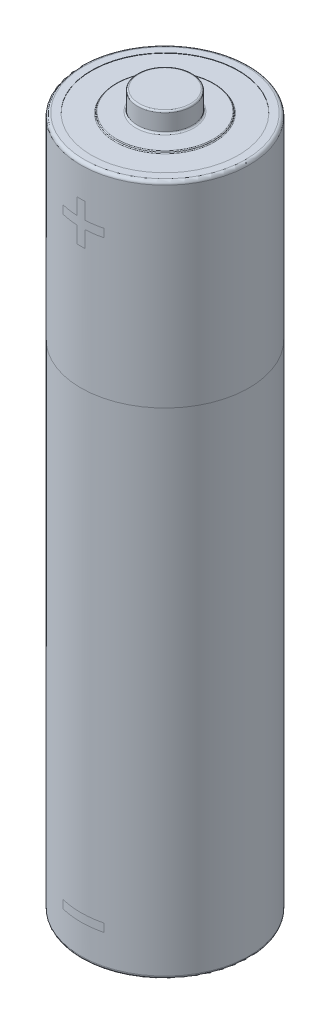
ISO-10303-21;
HEADER;
FILE_DESCRIPTION(('STEP AP214'),'2;1');
FILE_NAME('part.step','',(''),(''),'','','');
FILE_SCHEMA(('AUTOMOTIVE_DESIGN { 1 0 10303 214 1 1 1 1 }'));
ENDSEC;
DATA;
#1=APPLICATION_CONTEXT('core data for automotive mechanical design processes');
#2=APPLICATION_PROTOCOL_DEFINITION('international standard','automotive_design',2000,#1);
#3=PRODUCT_CONTEXT('',#1,'mechanical');
#4=PRODUCT('Part','Part','',(#3));
#5=PRODUCT_RELATED_PRODUCT_CATEGORY('part','',(#4));
#6=PRODUCT_DEFINITION_FORMATION('','',#4);
#7=PRODUCT_DEFINITION_CONTEXT('part definition',#1,'design');
#8=PRODUCT_DEFINITION('design','',#6,#7);
#9=PRODUCT_DEFINITION_SHAPE('','',#8);
#10=(LENGTH_UNIT() NAMED_UNIT(*) SI_UNIT(.MILLI.,.METRE.));
#11=(NAMED_UNIT(*) PLANE_ANGLE_UNIT() SI_UNIT($,.RADIAN.));
#12=(NAMED_UNIT(*) SI_UNIT($,.STERADIAN.) SOLID_ANGLE_UNIT());
#13=UNCERTAINTY_MEASURE_WITH_UNIT(LENGTH_MEASURE(1.E-05),#10,'distance_accuracy_value','');
#14=(GEOMETRIC_REPRESENTATION_CONTEXT(3) GLOBAL_UNCERTAINTY_ASSIGNED_CONTEXT((#13)) GLOBAL_UNIT_ASSIGNED_CONTEXT((#10,
#11,#12)) REPRESENTATION_CONTEXT('',''));
#15=CARTESIAN_POINT('',(0.,0.,0.));
#16=DIRECTION('',(0.,0.,1.));
#17=DIRECTION('',(1.,0.,0.));
#18=AXIS2_PLACEMENT_3D('',#15,#16,#17);
#19=CARTESIAN_POINT('',(0.,42.35,0.));
#20=DIRECTION('',(0.,-1.,0.));
#21=DIRECTION('',(0.,0.,-1.));
#22=AXIS2_PLACEMENT_3D('',#19,#20,#21);
#23=CYLINDRICAL_SURFACE('',#22,5.15);
#24=DIRECTION('',(0.,-1.,0.));
#25=VECTOR('',#24,1.);
#26=CARTESIAN_POINT('',(-1.25,42.35,4.99599839871872));
#27=LINE('',#26,#25);
#28=CARTESIAN_POINT('',(-1.25,2.5,4.99599839871872));
#29=VERTEX_POINT('',#28);
#30=CARTESIAN_POINT('',(-1.25,2.,4.99599839871872));
#31=VERTEX_POINT('',#30);
#32=EDGE_CURVE('E25',#29,#31,#27,.T.);
#33=ORIENTED_EDGE('',*,*,#32,.F.);
#34=CARTESIAN_POINT('',(0.,2.5,0.));
#35=DIRECTION('',(0.,-1.,0.));
#36=DIRECTION('',(0.,0.,-1.));
#37=AXIS2_PLACEMENT_3D('',#34,#35,#36);
#38=CIRCLE('',#37,5.15);
#39=CARTESIAN_POINT('',(1.25,2.5,4.99599839871872));
#40=VERTEX_POINT('',#39);
#41=EDGE_CURVE('E194',#40,#29,#38,.T.);
#42=ORIENTED_EDGE('',*,*,#41,.F.);
#43=DIRECTION('',(0.,-1.,0.));
#44=VECTOR('',#43,1.);
#45=CARTESIAN_POINT('',(1.25,42.35,4.99599839871872));
#46=LINE('',#45,#44);
#47=CARTESIAN_POINT('',(1.25,2.,4.99599839871872));
#48=VERTEX_POINT('',#47);
#49=EDGE_CURVE('E202',#48,#40,#46,.F.);
#50=ORIENTED_EDGE('',*,*,#49,.F.);
#51=CARTESIAN_POINT('',(0.,2.,0.));
#52=DIRECTION('',(0.,1.,0.));
#53=DIRECTION('',(0.,0.,1.));
#54=AXIS2_PLACEMENT_3D('',#51,#52,#53);
#55=CIRCLE('',#54,5.15);
#56=EDGE_CURVE('E35',#31,#48,#55,.T.);
#57=ORIENTED_EDGE('',*,*,#56,.F.);
#58=EDGE_LOOP('',(#33,#42,#50,#57));
#59=FACE_BOUND('',#58,.T.);
#60=CARTESIAN_POINT('',(0.,0.2,0.));
#61=DIRECTION('',(0.,1.,0.));
#62=DIRECTION('',(0.,0.,1.));
#63=AXIS2_PLACEMENT_3D('',#60,#61,#62);
#64=CIRCLE('',#63,5.15);
#65=CARTESIAN_POINT('',(0.,0.2,5.15));
#66=VERTEX_POINT('',#65);
#67=EDGE_CURVE('E212',#66,#66,#64,.T.);
#68=ORIENTED_EDGE('',*,*,#67,.T.);
#69=EDGE_LOOP('',(#68));
#70=FACE_BOUND('',#69,.T.);
#71=DIRECTION('',(0.,-1.,0.));
#72=VECTOR('',#71,1.);
#73=CARTESIAN_POINT('',(-1.25,42.35,-4.99599839871872));
#74=LINE('',#73,#72);
#75=CARTESIAN_POINT('',(-1.25,2.,-4.99599839871872));
#76=VERTEX_POINT('',#75);
#77=CARTESIAN_POINT('',(-1.25,2.5,-4.99599839871872));
#78=VERTEX_POINT('',#77);
#79=EDGE_CURVE('E200',#76,#78,#74,.F.);
#80=ORIENTED_EDGE('',*,*,#79,.F.);
#81=CARTESIAN_POINT('',(1.25,2.,-4.99599839871872));
#82=VERTEX_POINT('',#81);
#83=EDGE_CURVE('E197',#82,#76,#55,.T.);
#84=ORIENTED_EDGE('',*,*,#83,.F.);
#85=DIRECTION('',(0.,-1.,0.));
#86=VECTOR('',#85,1.);
#87=CARTESIAN_POINT('',(1.25,42.35,-4.99599839871872));
#88=LINE('',#87,#86);
#89=CARTESIAN_POINT('',(1.25,2.5,-4.99599839871872));
#90=VERTEX_POINT('',#89);
#91=EDGE_CURVE('E193',#90,#82,#88,.T.);
#92=ORIENTED_EDGE('',*,*,#91,.F.);
#93=EDGE_CURVE('E190',#78,#90,#38,.T.);
#94=ORIENTED_EDGE('',*,*,#93,.F.);
#95=EDGE_LOOP('',(#80,#84,#92,#94));
#96=FACE_BOUND('',#95,.T.);
#97=CARTESIAN_POINT('',(0.,30.33,0.));
#98=DIRECTION('',(0.,1.,0.));
#99=DIRECTION('',(0.,0.,1.));
#100=AXIS2_PLACEMENT_3D('',#97,#98,#99);
#101=CIRCLE('',#100,5.15);
#102=CARTESIAN_POINT('',(0.,30.33,5.15));
#103=VERTEX_POINT('',#102);
#104=EDGE_CURVE('E11',#103,#103,#101,.T.);
#105=ORIENTED_EDGE('',*,*,#104,.F.);
#106=EDGE_LOOP('',(#105));
#107=FACE_BOUND('',#106,.T.);
#108=ADVANCED_FACE('F17',(#59,#70,#96,#107),#23,.T.);
#109=ORIENTED_EDGE('',*,*,#104,.T.);
#110=EDGE_LOOP('',(#109));
#111=FACE_BOUND('',#110,.T.);
#112=CARTESIAN_POINT('',(0.,39.35,0.));
#113=DIRECTION('',(0.,-1.,0.));
#114=DIRECTION('',(0.,0.,-1.));
#115=AXIS2_PLACEMENT_3D('',#112,#113,#114);
#116=CIRCLE('',#115,5.15);
#117=CARTESIAN_POINT('',(-1.25,39.35,-4.99599839871872));
#118=VERTEX_POINT('',#117);
#119=CARTESIAN_POINT('',(-0.25,39.35,-5.14392845984467));
#120=VERTEX_POINT('',#119);
#121=EDGE_CURVE('E127',#118,#120,#116,.T.);
#122=ORIENTED_EDGE('',*,*,#121,.F.);
#123=DIRECTION('',(0.,-1.,0.));
#124=VECTOR('',#123,1.);
#125=CARTESIAN_POINT('',(-1.25,42.35,-4.99599839871872));
#126=LINE('',#125,#124);
#127=CARTESIAN_POINT('',(-1.25,38.85,-4.99599839871872));
#128=VERTEX_POINT('',#127);
#129=EDGE_CURVE('E133',#128,#118,#126,.F.);
#130=ORIENTED_EDGE('',*,*,#129,.F.);
#131=CARTESIAN_POINT('',(0.,38.85,0.));
#132=DIRECTION('',(0.,1.,0.));
#133=DIRECTION('',(0.,0.,1.));
#134=AXIS2_PLACEMENT_3D('',#131,#132,#133);
#135=CIRCLE('',#134,5.15);
#136=CARTESIAN_POINT('',(-0.25,38.85,-5.14392845984467));
#137=VERTEX_POINT('',#136);
#138=EDGE_CURVE('E174',#137,#128,#135,.T.);
#139=ORIENTED_EDGE('',*,*,#138,.F.);
#140=DIRECTION('',(0.,-1.,0.));
#141=VECTOR('',#140,1.);
#142=CARTESIAN_POINT('',(-0.25,42.35,-5.14392845984467));
#143=LINE('',#142,#141);
#144=CARTESIAN_POINT('',(-0.25,37.85,-5.14392845984467));
#145=VERTEX_POINT('',#144);
#146=EDGE_CURVE('E170',#145,#137,#143,.F.);
#147=ORIENTED_EDGE('',*,*,#146,.F.);
#148=CARTESIAN_POINT('',(0.,37.85,0.));
#149=DIRECTION('',(0.,1.,0.));
#150=DIRECTION('',(0.,0.,1.));
#151=AXIS2_PLACEMENT_3D('',#148,#149,#150);
#152=CIRCLE('',#151,5.15);
#153=CARTESIAN_POINT('',(0.25,37.85,-5.14392845984467));
#154=VERTEX_POINT('',#153);
#155=EDGE_CURVE('E167',#154,#145,#152,.T.);
#156=ORIENTED_EDGE('',*,*,#155,.F.);
#157=DIRECTION('',(0.,-1.,0.));
#158=VECTOR('',#157,1.);
#159=CARTESIAN_POINT('',(0.25,42.35,-5.14392845984467));
#160=LINE('',#159,#158);
#161=CARTESIAN_POINT('',(0.25,38.85,-5.14392845984467));
#162=VERTEX_POINT('',#161);
#163=EDGE_CURVE('E163',#162,#154,#160,.T.);
#164=ORIENTED_EDGE('',*,*,#163,.F.);
#165=CARTESIAN_POINT('',(0.,38.85,0.));
#166=DIRECTION('',(0.,1.,0.));
#167=DIRECTION('',(0.,0.,1.));
#168=AXIS2_PLACEMENT_3D('',#165,#166,#167);
#169=CIRCLE('',#168,5.15);
#170=CARTESIAN_POINT('',(1.25,38.85,-4.99599839871872));
#171=VERTEX_POINT('',#170);
#172=EDGE_CURVE('E160',#171,#162,#169,.T.);
#173=ORIENTED_EDGE('',*,*,#172,.F.);
#174=DIRECTION('',(0.,-1.,0.));
#175=VECTOR('',#174,1.);
#176=CARTESIAN_POINT('',(1.25,42.35,-4.99599839871872));
#177=LINE('',#176,#175);
#178=CARTESIAN_POINT('',(1.25,39.35,-4.99599839871872));
#179=VERTEX_POINT('',#178);
#180=EDGE_CURVE('E156',#179,#171,#177,.T.);
#181=ORIENTED_EDGE('',*,*,#180,.F.);
#182=CARTESIAN_POINT('',(0.,39.35,0.));
#183=DIRECTION('',(0.,-1.,0.));
#184=DIRECTION('',(0.,0.,-1.));
#185=AXIS2_PLACEMENT_3D('',#182,#183,#184);
#186=CIRCLE('',#185,5.15);
#187=CARTESIAN_POINT('',(0.25,39.35,-5.14392845984467));
#188=VERTEX_POINT('',#187);
#189=EDGE_CURVE('E153',#188,#179,#186,.T.);
#190=ORIENTED_EDGE('',*,*,#189,.F.);
#191=DIRECTION('',(0.,-1.,0.));
#192=VECTOR('',#191,1.);
#193=CARTESIAN_POINT('',(0.25,42.35,-5.14392845984467));
#194=LINE('',#193,#192);
#195=CARTESIAN_POINT('',(0.25,40.35,-5.14392845984467));
#196=VERTEX_POINT('',#195);
#197=EDGE_CURVE('E143',#196,#188,#194,.T.);
#198=ORIENTED_EDGE('',*,*,#197,.F.);
#199=CARTESIAN_POINT('',(0.,40.35,0.));
#200=DIRECTION('',(0.,-1.,0.));
#201=DIRECTION('',(0.,0.,-1.));
#202=AXIS2_PLACEMENT_3D('',#199,#200,#201);
#203=CIRCLE('',#202,5.15);
#204=CARTESIAN_POINT('',(-0.25,40.35,-5.14392845984467));
#205=VERTEX_POINT('',#204);
#206=EDGE_CURVE('E140',#205,#196,#203,.T.);
#207=ORIENTED_EDGE('',*,*,#206,.F.);
#208=DIRECTION('',(0.,-1.,0.));
#209=VECTOR('',#208,1.);
#210=CARTESIAN_POINT('',(-0.25,42.35,-5.14392845984467));
#211=LINE('',#210,#209);
#212=EDGE_CURVE('E131',#120,#205,#211,.F.);
#213=ORIENTED_EDGE('',*,*,#212,.F.);
#214=EDGE_LOOP('',(#122,#130,#139,#147,#156,#164,#173,#181,#190,#198,#207,#213));
#215=FACE_BOUND('',#214,.T.);
#216=CARTESIAN_POINT('',(0.,42.15,0.));
#217=DIRECTION('',(0.,1.,0.));
#218=DIRECTION('',(0.,0.,1.));
#219=AXIS2_PLACEMENT_3D('',#216,#217,#218);
#220=CIRCLE('',#219,5.15);
#221=CARTESIAN_POINT('',(0.,42.15,5.15));
#222=VERTEX_POINT('',#221);
#223=EDGE_CURVE('E268',#222,#222,#220,.F.);
#224=ORIENTED_EDGE('',*,*,#223,.T.);
#225=EDGE_LOOP('',(#224));
#226=FACE_BOUND('',#225,.T.);
#227=CARTESIAN_POINT('',(-0.25,39.35,5.14392845984467));
#228=VERTEX_POINT('',#227);
#229=CARTESIAN_POINT('',(-1.25,39.35,4.99599839871872));
#230=VERTEX_POINT('',#229);
#231=EDGE_CURVE('E137',#228,#230,#116,.T.);
#232=ORIENTED_EDGE('',*,*,#231,.F.);
#233=DIRECTION('',(0.,-1.,0.));
#234=VECTOR('',#233,1.);
#235=CARTESIAN_POINT('',(-0.25,42.35,5.14392845984467));
#236=LINE('',#235,#234);
#237=CARTESIAN_POINT('',(-0.25,40.35,5.14392845984467));
#238=VERTEX_POINT('',#237);
#239=EDGE_CURVE('E135',#238,#228,#236,.T.);
#240=ORIENTED_EDGE('',*,*,#239,.F.);
#241=CARTESIAN_POINT('',(0.25,40.35,5.14392845984467));
#242=VERTEX_POINT('',#241);
#243=EDGE_CURVE('E145',#242,#238,#203,.T.);
#244=ORIENTED_EDGE('',*,*,#243,.F.);
#245=DIRECTION('',(0.,-1.,0.));
#246=VECTOR('',#245,1.);
#247=CARTESIAN_POINT('',(0.25,42.35,5.14392845984467));
#248=LINE('',#247,#246);
#249=CARTESIAN_POINT('',(0.25,39.35,5.14392845984467));
#250=VERTEX_POINT('',#249);
#251=EDGE_CURVE('E180',#250,#242,#248,.F.);
#252=ORIENTED_EDGE('',*,*,#251,.F.);
#253=CARTESIAN_POINT('',(1.25,39.35,4.99599839871872));
#254=VERTEX_POINT('',#253);
#255=EDGE_CURVE('E157',#254,#250,#186,.T.);
#256=ORIENTED_EDGE('',*,*,#255,.F.);
#257=DIRECTION('',(0.,-1.,0.));
#258=VECTOR('',#257,1.);
#259=CARTESIAN_POINT('',(1.25,42.35,4.99599839871872));
#260=LINE('',#259,#258);
#261=CARTESIAN_POINT('',(1.25,38.85,4.99599839871872));
#262=VERTEX_POINT('',#261);
#263=EDGE_CURVE('E182',#262,#254,#260,.F.);
#264=ORIENTED_EDGE('',*,*,#263,.F.);
#265=CARTESIAN_POINT('',(0.25,38.85,5.14392845984467));
#266=VERTEX_POINT('',#265);
#267=EDGE_CURVE('E164',#266,#262,#169,.T.);
#268=ORIENTED_EDGE('',*,*,#267,.F.);
#269=DIRECTION('',(0.,-1.,0.));
#270=VECTOR('',#269,1.);
#271=CARTESIAN_POINT('',(0.25,42.35,5.14392845984467));
#272=LINE('',#271,#270);
#273=CARTESIAN_POINT('',(0.25,37.85,5.14392845984467));
#274=VERTEX_POINT('',#273);
#275=EDGE_CURVE('E184',#274,#266,#272,.F.);
#276=ORIENTED_EDGE('',*,*,#275,.F.);
#277=CARTESIAN_POINT('',(-0.25,37.85,5.14392845984467));
#278=VERTEX_POINT('',#277);
#279=EDGE_CURVE('E171',#278,#274,#152,.T.);
#280=ORIENTED_EDGE('',*,*,#279,.F.);
#281=DIRECTION('',(0.,-1.,0.));
#282=VECTOR('',#281,1.);
#283=CARTESIAN_POINT('',(-0.25,42.35,5.14392845984467));
#284=LINE('',#283,#282);
#285=CARTESIAN_POINT('',(-0.25,38.85,5.14392845984467));
#286=VERTEX_POINT('',#285);
#287=EDGE_CURVE('E186',#286,#278,#284,.T.);
#288=ORIENTED_EDGE('',*,*,#287,.F.);
#289=CARTESIAN_POINT('',(-1.25,38.85,4.99599839871872));
#290=VERTEX_POINT('',#289);
#291=EDGE_CURVE('E176',#290,#286,#135,.T.);
#292=ORIENTED_EDGE('',*,*,#291,.F.);
#293=DIRECTION('',(0.,-1.,0.));
#294=VECTOR('',#293,1.);
#295=CARTESIAN_POINT('',(-1.25,42.35,4.99599839871872));
#296=LINE('',#295,#294);
#297=EDGE_CURVE('E188',#230,#290,#296,.T.);
#298=ORIENTED_EDGE('',*,*,#297,.F.);
#299=EDGE_LOOP('',(#232,#240,#244,#252,#256,#264,#268,#276,#280,#288,#292,#298));
#300=FACE_BOUND('',#299,.T.);
#301=ADVANCED_FACE('F138',(#111,#215,#226,#300),#23,.T.);
#302=ORIENTED_EDGE('',*,*,#41,.T.);
#303=ORIENTED_EDGE('',*,*,#32,.T.);
#304=ORIENTED_EDGE('',*,*,#56,.T.);
#305=ORIENTED_EDGE('',*,*,#49,.T.);
#306=EDGE_LOOP('',(#302,#303,#304,#305));
#307=FACE_BOUND('',#306,.T.);
#308=ADVANCED_FACE('F204',(#307),#23,.T.);
#309=ORIENTED_EDGE('',*,*,#83,.T.);
#310=ORIENTED_EDGE('',*,*,#79,.T.);
#311=ORIENTED_EDGE('',*,*,#93,.T.);
#312=ORIENTED_EDGE('',*,*,#91,.T.);
#313=EDGE_LOOP('',(#309,#310,#311,#312));
#314=FACE_BOUND('',#313,.T.);
#315=ADVANCED_FACE('F222',(#314),#23,.T.);
#316=ORIENTED_EDGE('',*,*,#239,.T.);
#317=ORIENTED_EDGE('',*,*,#231,.T.);
#318=ORIENTED_EDGE('',*,*,#297,.T.);
#319=ORIENTED_EDGE('',*,*,#291,.T.);
#320=ORIENTED_EDGE('',*,*,#287,.T.);
#321=ORIENTED_EDGE('',*,*,#279,.T.);
#322=ORIENTED_EDGE('',*,*,#275,.T.);
#323=ORIENTED_EDGE('',*,*,#267,.T.);
#324=ORIENTED_EDGE('',*,*,#263,.T.);
#325=ORIENTED_EDGE('',*,*,#255,.T.);
#326=ORIENTED_EDGE('',*,*,#251,.T.);
#327=ORIENTED_EDGE('',*,*,#243,.T.);
#328=EDGE_LOOP('',(#316,#317,#318,#319,#320,#321,#322,#323,#324,#325,#326,#327));
#329=FACE_BOUND('',#328,.T.);
#330=ADVANCED_FACE('F227',(#329),#23,.T.);
#331=ORIENTED_EDGE('',*,*,#129,.T.);
#332=ORIENTED_EDGE('',*,*,#121,.T.);
#333=ORIENTED_EDGE('',*,*,#212,.T.);
#334=ORIENTED_EDGE('',*,*,#206,.T.);
#335=ORIENTED_EDGE('',*,*,#197,.T.);
#336=ORIENTED_EDGE('',*,*,#189,.T.);
#337=ORIENTED_EDGE('',*,*,#180,.T.);
#338=ORIENTED_EDGE('',*,*,#172,.T.);
#339=ORIENTED_EDGE('',*,*,#163,.T.);
#340=ORIENTED_EDGE('',*,*,#155,.T.);
#341=ORIENTED_EDGE('',*,*,#146,.T.);
#342=ORIENTED_EDGE('',*,*,#138,.T.);
#343=EDGE_LOOP('',(#331,#332,#333,#334,#335,#336,#337,#338,#339,#340,#341,#342));
#344=FACE_BOUND('',#343,.T.);
#345=ADVANCED_FACE('F129',(#344),#23,.T.);
#346=CARTESIAN_POINT('',(0.,42.35,0.));
#347=DIRECTION('',(0.,1.,0.));
#348=DIRECTION('',(0.,0.,1.));
#349=AXIS2_PLACEMENT_3D('',#346,#347,#348);
#350=PLANE('',#349);
#351=CARTESIAN_POINT('',(0.,42.35,0.));
#352=DIRECTION('',(0.,1.,0.));
#353=DIRECTION('',(0.,0.,1.));
#354=AXIS2_PLACEMENT_3D('',#351,#352,#353);
#355=CIRCLE('',#354,4.95);
#356=CARTESIAN_POINT('',(0.,42.35,4.95));
#357=VERTEX_POINT('',#356);
#358=EDGE_CURVE('E141',#357,#357,#355,.T.);
#359=ORIENTED_EDGE('',*,*,#358,.T.);
#360=EDGE_LOOP('',(#359));
#361=FACE_BOUND('',#360,.T.);
#362=CARTESIAN_POINT('',(0.,42.35,0.));
#363=DIRECTION('',(0.,1.,0.));
#364=DIRECTION('',(0.,0.,1.));
#365=AXIS2_PLACEMENT_3D('',#362,#363,#364);
#366=CIRCLE('',#365,4.5);
#367=CARTESIAN_POINT('',(0.,42.35,4.5));
#368=VERTEX_POINT('',#367);
#369=EDGE_CURVE('E298',#368,#368,#366,.T.);
#370=ORIENTED_EDGE('',*,*,#369,.F.);
#371=EDGE_LOOP('',(#370));
#372=FACE_BOUND('',#371,.T.);
#373=ADVANCED_FACE('F226',(#361,#372),#350,.T.);
#374=CARTESIAN_POINT('',(0.,0.,0.));
#375=DIRECTION('',(0.,1.,0.));
#376=DIRECTION('',(0.,0.,1.));
#377=AXIS2_PLACEMENT_3D('',#374,#375,#376);
#378=PLANE('',#377);
#379=CARTESIAN_POINT('',(0.,0.,0.));
#380=DIRECTION('',(0.,1.,0.));
#381=DIRECTION('',(0.,0.,1.));
#382=AXIS2_PLACEMENT_3D('',#379,#380,#381);
#383=CIRCLE('',#382,4.95);
#384=CARTESIAN_POINT('',(0.,0.,4.95));
#385=VERTEX_POINT('',#384);
#386=EDGE_CURVE('E147',#385,#385,#383,.F.);
#387=ORIENTED_EDGE('',*,*,#386,.T.);
#388=EDGE_LOOP('',(#387));
#389=FACE_BOUND('',#388,.T.);
#390=CARTESIAN_POINT('',(0.,0.,0.));
#391=DIRECTION('',(0.,1.,0.));
#392=DIRECTION('',(0.,0.,1.));
#393=AXIS2_PLACEMENT_3D('',#390,#391,#392);
#394=CIRCLE('',#393,3.1);
#395=CARTESIAN_POINT('',(0.,0.,3.1));
#396=VERTEX_POINT('',#395);
#397=EDGE_CURVE('E280',#396,#396,#394,.T.);
#398=ORIENTED_EDGE('',*,*,#397,.T.);
#399=EDGE_LOOP('',(#398));
#400=FACE_BOUND('',#399,.T.);
#401=ADVANCED_FACE('F228',(#389,#400),#378,.F.);
#402=CARTESIAN_POINT('',(0.,42.33,0.));
#403=DIRECTION('',(0.,1.,0.));
#404=DIRECTION('',(0.,0.,1.));
#405=AXIS2_PLACEMENT_3D('',#402,#403,#404);
#406=CYLINDRICAL_SURFACE('',#405,4.5);
#407=CARTESIAN_POINT('',(0.,42.33,0.));
#408=DIRECTION('',(0.,1.,0.));
#409=DIRECTION('',(0.,0.,1.));
#410=AXIS2_PLACEMENT_3D('',#407,#408,#409);
#411=CIRCLE('',#410,4.5);
#412=CARTESIAN_POINT('',(0.,42.33,4.5));
#413=VERTEX_POINT('',#412);
#414=EDGE_CURVE('E304',#413,#413,#411,.T.);
#415=ORIENTED_EDGE('',*,*,#414,.F.);
#416=EDGE_LOOP('',(#415));
#417=FACE_BOUND('',#416,.T.);
#418=ORIENTED_EDGE('',*,*,#369,.T.);
#419=EDGE_LOOP('',(#418));
#420=FACE_BOUND('',#419,.T.);
#421=ADVANCED_FACE('F312',(#417,#420),#406,.F.);
#422=CARTESIAN_POINT('',(0.,42.33,0.));
#423=DIRECTION('',(0.,1.,0.));
#424=DIRECTION('',(0.,0.,1.));
#425=AXIS2_PLACEMENT_3D('',#422,#423,#424);
#426=PLANE('',#425);
#427=CARTESIAN_POINT('',(0.,42.33,0.));
#428=DIRECTION('',(0.,1.,0.));
#429=DIRECTION('',(0.,0.,1.));
#430=AXIS2_PLACEMENT_3D('',#427,#428,#429);
#431=CIRCLE('',#430,3.05);
#432=CARTESIAN_POINT('',(0.,42.33,3.05));
#433=VERTEX_POINT('',#432);
#434=EDGE_CURVE('E301',#433,#433,#431,.F.);
#435=ORIENTED_EDGE('',*,*,#434,.T.);
#436=EDGE_LOOP('',(#435));
#437=FACE_BOUND('',#436,.T.);
#438=ORIENTED_EDGE('',*,*,#414,.T.);
#439=EDGE_LOOP('',(#438));
#440=FACE_BOUND('',#439,.T.);
#441=ADVANCED_FACE('F310',(#437,#440),#426,.T.);
#442=CARTESIAN_POINT('',(0.,42.43,0.));
#443=DIRECTION('',(0.,1.,0.));
#444=DIRECTION('',(0.,0.,1.));
#445=AXIS2_PLACEMENT_3D('',#442,#443,#444);
#446=PLANE('',#445);
#447=CARTESIAN_POINT('',(0.,42.43,0.));
#448=DIRECTION('',(0.,1.,0.));
#449=DIRECTION('',(0.,0.,1.));
#450=AXIS2_PLACEMENT_3D('',#447,#448,#449);
#451=CIRCLE('',#450,1.775);
#452=CARTESIAN_POINT('',(0.,42.43,1.775));
#453=VERTEX_POINT('',#452);
#454=EDGE_CURVE('E283',#453,#453,#451,.F.);
#455=ORIENTED_EDGE('',*,*,#454,.T.);
#456=EDGE_LOOP('',(#455));
#457=FACE_BOUND('',#456,.T.);
#458=CARTESIAN_POINT('',(0.,42.43,0.));
#459=DIRECTION('',(0.,1.,0.));
#460=DIRECTION('',(0.,0.,1.));
#461=AXIS2_PLACEMENT_3D('',#458,#459,#460);
#462=CIRCLE('',#461,2.95);
#463=CARTESIAN_POINT('',(0.,42.43,2.95));
#464=VERTEX_POINT('',#463);
#465=EDGE_CURVE('E295',#464,#464,#462,.T.);
#466=ORIENTED_EDGE('',*,*,#465,.T.);
#467=EDGE_LOOP('',(#466));
#468=FACE_BOUND('',#467,.T.);
#469=ADVANCED_FACE('F238',(#457,#468),#446,.T.);
#470=CARTESIAN_POINT('',(0.,42.38,0.));
#471=DIRECTION('',(0.,1.,0.));
#472=DIRECTION('',(0.,0.,1.));
#473=AXIS2_PLACEMENT_3D('',#470,#471,#472);
#474=TOROIDAL_SURFACE('',#473,2.95,0.05);
#475=ORIENTED_EDGE('',*,*,#465,.F.);
#476=EDGE_LOOP('',(#475));
#477=FACE_BOUND('',#476,.T.);
#478=CARTESIAN_POINT('',(0.,42.38,0.));
#479=DIRECTION('',(0.,1.,0.));
#480=DIRECTION('',(0.,0.,1.));
#481=AXIS2_PLACEMENT_3D('',#478,#479,#480);
#482=CIRCLE('',#481,3.);
#483=CARTESIAN_POINT('',(0.,42.38,3.));
#484=VERTEX_POINT('',#483);
#485=EDGE_CURVE('E277',#484,#484,#482,.F.);
#486=ORIENTED_EDGE('',*,*,#485,.F.);
#487=EDGE_LOOP('',(#486));
#488=FACE_BOUND('',#487,.T.);
#489=ADVANCED_FACE('F234',(#477,#488),#474,.T.);
#490=CARTESIAN_POINT('',(0.,42.38,0.));
#491=DIRECTION('',(0.,1.,0.));
#492=DIRECTION('',(0.,0.,1.));
#493=AXIS2_PLACEMENT_3D('',#490,#491,#492);
#494=TOROIDAL_SURFACE('',#493,3.05,0.05);
#495=ORIENTED_EDGE('',*,*,#434,.F.);
#496=EDGE_LOOP('',(#495));
#497=FACE_BOUND('',#496,.T.);
#498=ORIENTED_EDGE('',*,*,#485,.T.);
#499=EDGE_LOOP('',(#498));
#500=FACE_BOUND('',#499,.T.);
#501=ADVANCED_FACE('F230',(#497,#500),#494,.F.);
#502=CARTESIAN_POINT('',(0.,43.63,0.));
#503=DIRECTION('',(0.,-1.,0.));
#504=DIRECTION('',(0.,0.,-1.));
#505=AXIS2_PLACEMENT_3D('',#502,#503,#504);
#506=CYLINDRICAL_SURFACE('',#505,1.675);
#507=CARTESIAN_POINT('',(0.,43.53,0.));
#508=DIRECTION('',(0.,1.,0.));
#509=DIRECTION('',(0.,0.,1.));
#510=AXIS2_PLACEMENT_3D('',#507,#508,#509);
#511=CIRCLE('',#510,1.675);
#512=CARTESIAN_POINT('',(0.,43.53,1.675));
#513=VERTEX_POINT('',#512);
#514=EDGE_CURVE('E286',#513,#513,#511,.F.);
#515=ORIENTED_EDGE('',*,*,#514,.T.);
#516=EDGE_LOOP('',(#515));
#517=FACE_BOUND('',#516,.T.);
#518=CARTESIAN_POINT('',(0.,42.53,0.));
#519=DIRECTION('',(0.,1.,0.));
#520=DIRECTION('',(0.,0.,1.));
#521=AXIS2_PLACEMENT_3D('',#518,#519,#520);
#522=CIRCLE('',#521,1.675);
#523=CARTESIAN_POINT('',(0.,42.53,1.675));
#524=VERTEX_POINT('',#523);
#525=EDGE_CURVE('E289',#524,#524,#522,.T.);
#526=ORIENTED_EDGE('',*,*,#525,.T.);
#527=EDGE_LOOP('',(#526));
#528=FACE_BOUND('',#527,.T.);
#529=ADVANCED_FACE('F233',(#517,#528),#506,.T.);
#530=CARTESIAN_POINT('',(0.,43.63,0.));
#531=DIRECTION('',(0.,1.,0.));
#532=DIRECTION('',(0.,0.,1.));
#533=AXIS2_PLACEMENT_3D('',#530,#531,#532);
#534=PLANE('',#533);
#535=CARTESIAN_POINT('',(0.,43.63,0.));
#536=DIRECTION('',(0.,1.,0.));
#537=DIRECTION('',(0.,0.,1.));
#538=AXIS2_PLACEMENT_3D('',#535,#536,#537);
#539=CIRCLE('',#538,1.575);
#540=CARTESIAN_POINT('',(0.,43.63,1.575));
#541=VERTEX_POINT('',#540);
#542=EDGE_CURVE('E292',#541,#541,#539,.T.);
#543=ORIENTED_EDGE('',*,*,#542,.T.);
#544=EDGE_LOOP('',(#543));
#545=FACE_BOUND('',#544,.T.);
#546=ADVANCED_FACE('F244',(#545),#534,.T.);
#547=CARTESIAN_POINT('',(0.,43.53,0.));
#548=DIRECTION('',(0.,1.,0.));
#549=DIRECTION('',(0.,0.,1.));
#550=AXIS2_PLACEMENT_3D('',#547,#548,#549);
#551=TOROIDAL_SURFACE('',#550,1.575,0.1);
#552=ORIENTED_EDGE('',*,*,#514,.F.);
#553=EDGE_LOOP('',(#552));
#554=FACE_BOUND('',#553,.T.);
#555=ORIENTED_EDGE('',*,*,#542,.F.);
#556=EDGE_LOOP('',(#555));
#557=FACE_BOUND('',#556,.T.);
#558=ADVANCED_FACE('F240',(#554,#557),#551,.T.);
#559=CARTESIAN_POINT('',(0.,42.53,0.));
#560=DIRECTION('',(0.,1.,0.));
#561=DIRECTION('',(0.,0.,1.));
#562=AXIS2_PLACEMENT_3D('',#559,#560,#561);
#563=TOROIDAL_SURFACE('',#562,1.775,0.1);
#564=ORIENTED_EDGE('',*,*,#454,.F.);
#565=EDGE_LOOP('',(#564));
#566=FACE_BOUND('',#565,.T.);
#567=ORIENTED_EDGE('',*,*,#525,.F.);
#568=EDGE_LOOP('',(#567));
#569=FACE_BOUND('',#568,.T.);
#570=ADVANCED_FACE('F243',(#566,#569),#563,.F.);
#571=CARTESIAN_POINT('',(0.,-0.2,0.));
#572=DIRECTION('',(0.,-1.,0.));
#573=DIRECTION('',(0.,0.,-1.));
#574=AXIS2_PLACEMENT_3D('',#571,#572,#573);
#575=PLANE('',#574);
#576=CARTESIAN_POINT('',(0.,-0.2,0.));
#577=DIRECTION('',(0.,-1.,0.));
#578=DIRECTION('',(0.,0.,-1.));
#579=AXIS2_PLACEMENT_3D('',#576,#577,#578);
#580=CIRCLE('',#579,2.9);
#581=CARTESIAN_POINT('',(0.,-0.2,-2.9));
#582=VERTEX_POINT('',#581);
#583=EDGE_CURVE('E271',#582,#582,#580,.T.);
#584=ORIENTED_EDGE('',*,*,#583,.T.);
#585=EDGE_LOOP('',(#584));
#586=FACE_BOUND('',#585,.T.);
#587=ADVANCED_FACE('F248',(#586),#575,.T.);
#588=CARTESIAN_POINT('',(0.,-0.1,0.));
#589=DIRECTION('',(0.,-1.,0.));
#590=DIRECTION('',(0.,0.,-1.));
#591=AXIS2_PLACEMENT_3D('',#588,#589,#590);
#592=TOROIDAL_SURFACE('',#591,2.9,0.1);
#593=ORIENTED_EDGE('',*,*,#583,.F.);
#594=EDGE_LOOP('',(#593));
#595=FACE_BOUND('',#594,.T.);
#596=CARTESIAN_POINT('',(0.,-0.1,0.));
#597=DIRECTION('',(0.,-1.,0.));
#598=DIRECTION('',(0.,0.,-1.));
#599=AXIS2_PLACEMENT_3D('',#596,#597,#598);
#600=CIRCLE('',#599,3.);
#601=CARTESIAN_POINT('',(0.,-0.1,-3.));
#602=VERTEX_POINT('',#601);
#603=EDGE_CURVE('E274',#602,#602,#600,.F.);
#604=ORIENTED_EDGE('',*,*,#603,.F.);
#605=EDGE_LOOP('',(#604));
#606=FACE_BOUND('',#605,.T.);
#607=ADVANCED_FACE('F254',(#595,#606),#592,.T.);
#608=CARTESIAN_POINT('',(0.,-0.1,0.));
#609=DIRECTION('',(0.,1.,0.));
#610=DIRECTION('',(0.,0.,1.));
#611=AXIS2_PLACEMENT_3D('',#608,#609,#610);
#612=TOROIDAL_SURFACE('',#611,3.1,0.1);
#613=ORIENTED_EDGE('',*,*,#397,.F.);
#614=EDGE_LOOP('',(#613));
#615=FACE_BOUND('',#614,.T.);
#616=ORIENTED_EDGE('',*,*,#603,.T.);
#617=EDGE_LOOP('',(#616));
#618=FACE_BOUND('',#617,.T.);
#619=ADVANCED_FACE('F250',(#615,#618),#612,.F.);
#620=CARTESIAN_POINT('',(0.,0.2,0.));
#621=DIRECTION('',(0.,1.,0.));
#622=DIRECTION('',(0.,0.,1.));
#623=AXIS2_PLACEMENT_3D('',#620,#621,#622);
#624=TOROIDAL_SURFACE('',#623,4.95,0.2);
#625=ORIENTED_EDGE('',*,*,#386,.F.);
#626=EDGE_LOOP('',(#625));
#627=FACE_BOUND('',#626,.T.);
#628=ORIENTED_EDGE('',*,*,#67,.F.);
#629=EDGE_LOOP('',(#628));
#630=FACE_BOUND('',#629,.T.);
#631=ADVANCED_FACE('F253',(#627,#630),#624,.T.);
#632=CARTESIAN_POINT('',(0.,42.15,0.));
#633=DIRECTION('',(0.,1.,0.));
#634=DIRECTION('',(0.,0.,1.));
#635=AXIS2_PLACEMENT_3D('',#632,#633,#634);
#636=TOROIDAL_SURFACE('',#635,4.95,0.2);
#637=ORIENTED_EDGE('',*,*,#223,.F.);
#638=EDGE_LOOP('',(#637));
#639=FACE_BOUND('',#638,.T.);
#640=ORIENTED_EDGE('',*,*,#358,.F.);
#641=EDGE_LOOP('',(#640));
#642=FACE_BOUND('',#641,.T.);
#643=ADVANCED_FACE('F19',(#639,#642),#636,.T.);
#644=CLOSED_SHELL('',(#108,#301,#308,#315,#330,#345,#373,#401,#421,#441,#469,#489,#501,#529,
#546,#558,#570,#587,#607,#619,#631,#643));
#645=MANIFOLD_SOLID_BREP('B1',#644);
#646=ADVANCED_BREP_SHAPE_REPRESENTATION('',(#18,#645),#14);
#647=SHAPE_DEFINITION_REPRESENTATION(#9,#646);
ENDSEC;
END-ISO-10303-21;
